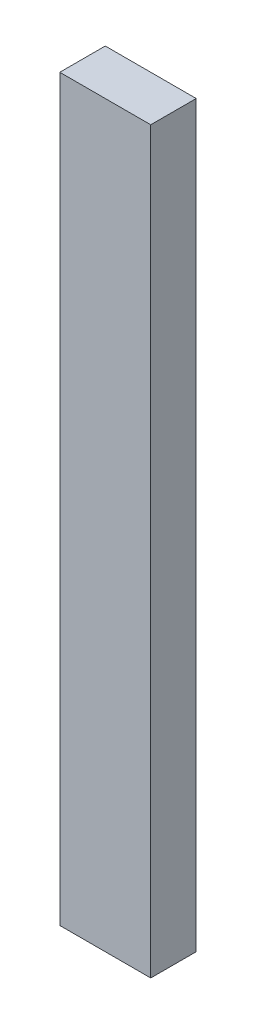
ISO-10303-21;
HEADER;
FILE_DESCRIPTION(('STEP AP214'),'2;1');
FILE_NAME('part.step','',(''),(''),'','','');
FILE_SCHEMA(('AUTOMOTIVE_DESIGN { 1 0 10303 214 1 1 1 1 }'));
ENDSEC;
DATA;
#1=APPLICATION_CONTEXT('core data for automotive mechanical design processes');
#2=APPLICATION_PROTOCOL_DEFINITION('international standard','automotive_design',2000,#1);
#3=PRODUCT_CONTEXT('',#1,'mechanical');
#4=PRODUCT('Part','Part','',(#3));
#5=PRODUCT_RELATED_PRODUCT_CATEGORY('part','',(#4));
#6=PRODUCT_DEFINITION_FORMATION('','',#4);
#7=PRODUCT_DEFINITION_CONTEXT('part definition',#1,'design');
#8=PRODUCT_DEFINITION('design','',#6,#7);
#9=PRODUCT_DEFINITION_SHAPE('','',#8);
#10=(LENGTH_UNIT() NAMED_UNIT(*) SI_UNIT(.MILLI.,.METRE.));
#11=(NAMED_UNIT(*) PLANE_ANGLE_UNIT() SI_UNIT($,.RADIAN.));
#12=(NAMED_UNIT(*) SI_UNIT($,.STERADIAN.) SOLID_ANGLE_UNIT());
#13=UNCERTAINTY_MEASURE_WITH_UNIT(LENGTH_MEASURE(1.E-05),#10,'distance_accuracy_value','');
#14=(GEOMETRIC_REPRESENTATION_CONTEXT(3) GLOBAL_UNCERTAINTY_ASSIGNED_CONTEXT((#13)) GLOBAL_UNIT_ASSIGNED_CONTEXT((#10,
#11,#12)) REPRESENTATION_CONTEXT('',''));
#15=CARTESIAN_POINT('',(0.,0.,0.));
#16=DIRECTION('',(0.,0.,1.));
#17=DIRECTION('',(1.,0.,0.));
#18=AXIS2_PLACEMENT_3D('',#15,#16,#17);
#19=CARTESIAN_POINT('',(0.,0.,1.016));
#20=DIRECTION('',(1.,0.,0.));
#21=DIRECTION('',(0.,1.,0.));
#22=AXIS2_PLACEMENT_3D('',#19,#20,#21);
#23=PLANE('',#22);
#24=DIRECTION('',(0.,-1.,0.));
#25=VECTOR('',#24,1.);
#26=CARTESIAN_POINT('',(0.,0.,0.));
#27=LINE('',#26,#25);
#28=CARTESIAN_POINT('',(0.,0.,0.));
#29=VERTEX_POINT('',#28);
#30=CARTESIAN_POINT('',(0.,-16.51,0.));
#31=VERTEX_POINT('',#30);
#32=EDGE_CURVE('E107',#29,#31,#27,.T.);
#33=ORIENTED_EDGE('',*,*,#32,.T.);
#34=DIRECTION('',(0.,0.,-1.));
#35=VECTOR('',#34,1.);
#36=CARTESIAN_POINT('',(0.,-16.51,1.016));
#37=LINE('',#36,#35);
#38=CARTESIAN_POINT('',(0.,-16.51,1.016));
#39=VERTEX_POINT('',#38);
#40=EDGE_CURVE('E11',#39,#31,#37,.T.);
#41=ORIENTED_EDGE('',*,*,#40,.F.);
#42=DIRECTION('',(0.,-1.,0.));
#43=VECTOR('',#42,1.);
#44=CARTESIAN_POINT('',(0.,0.,1.016));
#45=LINE('',#44,#43);
#46=CARTESIAN_POINT('',(0.,0.,1.016));
#47=VERTEX_POINT('',#46);
#48=EDGE_CURVE('E91',#47,#39,#45,.T.);
#49=ORIENTED_EDGE('',*,*,#48,.F.);
#50=DIRECTION('',(0.,0.,-1.));
#51=VECTOR('',#50,1.);
#52=CARTESIAN_POINT('',(0.,0.,1.016));
#53=LINE('',#52,#51);
#54=EDGE_CURVE('E103',#47,#29,#53,.T.);
#55=ORIENTED_EDGE('',*,*,#54,.T.);
#56=EDGE_LOOP('',(#33,#41,#49,#55));
#57=FACE_BOUND('',#56,.T.);
#58=ADVANCED_FACE('F39',(#57),#23,.F.);
#59=CARTESIAN_POINT('',(0.,-16.51,1.016));
#60=DIRECTION('',(0.,1.,0.));
#61=DIRECTION('',(0.,0.,1.));
#62=AXIS2_PLACEMENT_3D('',#59,#60,#61);
#63=PLANE('',#62);
#64=DIRECTION('',(1.,0.,0.));
#65=VECTOR('',#64,1.);
#66=CARTESIAN_POINT('',(0.,-16.51,0.));
#67=LINE('',#66,#65);
#68=CARTESIAN_POINT('',(2.032,-16.51,0.));
#69=VERTEX_POINT('',#68);
#70=EDGE_CURVE('E96',#31,#69,#67,.T.);
#71=ORIENTED_EDGE('',*,*,#70,.T.);
#72=DIRECTION('',(0.,0.,-1.));
#73=VECTOR('',#72,1.);
#74=CARTESIAN_POINT('',(2.032,-16.51,1.016));
#75=LINE('',#74,#73);
#76=CARTESIAN_POINT('',(2.032,-16.51,1.016));
#77=VERTEX_POINT('',#76);
#78=EDGE_CURVE('E48',#77,#69,#75,.T.);
#79=ORIENTED_EDGE('',*,*,#78,.F.);
#80=DIRECTION('',(1.,0.,0.));
#81=VECTOR('',#80,1.);
#82=CARTESIAN_POINT('',(0.,-16.51,1.016));
#83=LINE('',#82,#81);
#84=EDGE_CURVE('E86',#39,#77,#83,.T.);
#85=ORIENTED_EDGE('',*,*,#84,.F.);
#86=ORIENTED_EDGE('',*,*,#40,.T.);
#87=EDGE_LOOP('',(#71,#79,#85,#86));
#88=FACE_BOUND('',#87,.T.);
#89=ADVANCED_FACE('F95',(#88),#63,.F.);
#90=CARTESIAN_POINT('',(2.032,0.,1.016));
#91=DIRECTION('',(-1.,0.,0.));
#92=DIRECTION('',(0.,-1.,0.));
#93=AXIS2_PLACEMENT_3D('',#90,#91,#92);
#94=PLANE('',#93);
#95=DIRECTION('',(0.,1.,0.));
#96=VECTOR('',#95,1.);
#97=CARTESIAN_POINT('',(2.032,0.,0.));
#98=LINE('',#97,#96);
#99=CARTESIAN_POINT('',(2.032,0.,0.));
#100=VERTEX_POINT('',#99);
#101=EDGE_CURVE('E73',#69,#100,#98,.T.);
#102=ORIENTED_EDGE('',*,*,#101,.T.);
#103=DIRECTION('',(0.,0.,-1.));
#104=VECTOR('',#103,1.);
#105=CARTESIAN_POINT('',(2.032,0.,1.016));
#106=LINE('',#105,#104);
#107=CARTESIAN_POINT('',(2.032,0.,1.016));
#108=VERTEX_POINT('',#107);
#109=EDGE_CURVE('E98',#108,#100,#106,.T.);
#110=ORIENTED_EDGE('',*,*,#109,.F.);
#111=DIRECTION('',(0.,1.,0.));
#112=VECTOR('',#111,1.);
#113=CARTESIAN_POINT('',(2.032,0.,1.016));
#114=LINE('',#113,#112);
#115=EDGE_CURVE('E89',#77,#108,#114,.T.);
#116=ORIENTED_EDGE('',*,*,#115,.F.);
#117=ORIENTED_EDGE('',*,*,#78,.T.);
#118=EDGE_LOOP('',(#102,#110,#116,#117));
#119=FACE_BOUND('',#118,.T.);
#120=ADVANCED_FACE('F99',(#119),#94,.F.);
#121=CARTESIAN_POINT('',(0.,0.,1.016));
#122=DIRECTION('',(0.,-1.,0.));
#123=DIRECTION('',(0.,0.,-1.));
#124=AXIS2_PLACEMENT_3D('',#121,#122,#123);
#125=PLANE('',#124);
#126=DIRECTION('',(-1.,0.,0.));
#127=VECTOR('',#126,1.);
#128=CARTESIAN_POINT('',(0.,0.,0.));
#129=LINE('',#128,#127);
#130=EDGE_CURVE('E79',#100,#29,#129,.T.);
#131=ORIENTED_EDGE('',*,*,#130,.T.);
#132=ORIENTED_EDGE('',*,*,#54,.F.);
#133=DIRECTION('',(-1.,0.,0.));
#134=VECTOR('',#133,1.);
#135=CARTESIAN_POINT('',(0.,0.,1.016));
#136=LINE('',#135,#134);
#137=EDGE_CURVE('E56',#108,#47,#136,.T.);
#138=ORIENTED_EDGE('',*,*,#137,.F.);
#139=ORIENTED_EDGE('',*,*,#109,.T.);
#140=EDGE_LOOP('',(#131,#132,#138,#139));
#141=FACE_BOUND('',#140,.T.);
#142=ADVANCED_FACE('F120',(#141),#125,.F.);
#143=CARTESIAN_POINT('',(0.,0.,1.016));
#144=DIRECTION('',(0.,0.,1.));
#145=DIRECTION('',(1.,0.,0.));
#146=AXIS2_PLACEMENT_3D('',#143,#144,#145);
#147=PLANE('',#146);
#148=ORIENTED_EDGE('',*,*,#48,.T.);
#149=ORIENTED_EDGE('',*,*,#84,.T.);
#150=ORIENTED_EDGE('',*,*,#115,.T.);
#151=ORIENTED_EDGE('',*,*,#137,.T.);
#152=EDGE_LOOP('',(#148,#149,#150,#151));
#153=FACE_BOUND('',#152,.T.);
#154=ADVANCED_FACE('F87',(#153),#147,.T.);
#155=CARTESIAN_POINT('',(0.,0.,0.));
#156=DIRECTION('',(0.,0.,1.));
#157=DIRECTION('',(1.,0.,0.));
#158=AXIS2_PLACEMENT_3D('',#155,#156,#157);
#159=PLANE('',#158);
#160=ORIENTED_EDGE('',*,*,#32,.F.);
#161=ORIENTED_EDGE('',*,*,#130,.F.);
#162=ORIENTED_EDGE('',*,*,#101,.F.);
#163=ORIENTED_EDGE('',*,*,#70,.F.);
#164=EDGE_LOOP('',(#160,#161,#162,#163));
#165=FACE_BOUND('',#164,.T.);
#166=ADVANCED_FACE('F123',(#165),#159,.F.);
#167=CLOSED_SHELL('',(#58,#89,#120,#142,#154,#166));
#168=MANIFOLD_SOLID_BREP('B2',#167);
#169=ADVANCED_BREP_SHAPE_REPRESENTATION('',(#18,#168),#14);
#170=SHAPE_DEFINITION_REPRESENTATION(#9,#169);
ENDSEC;
END-ISO-10303-21;
